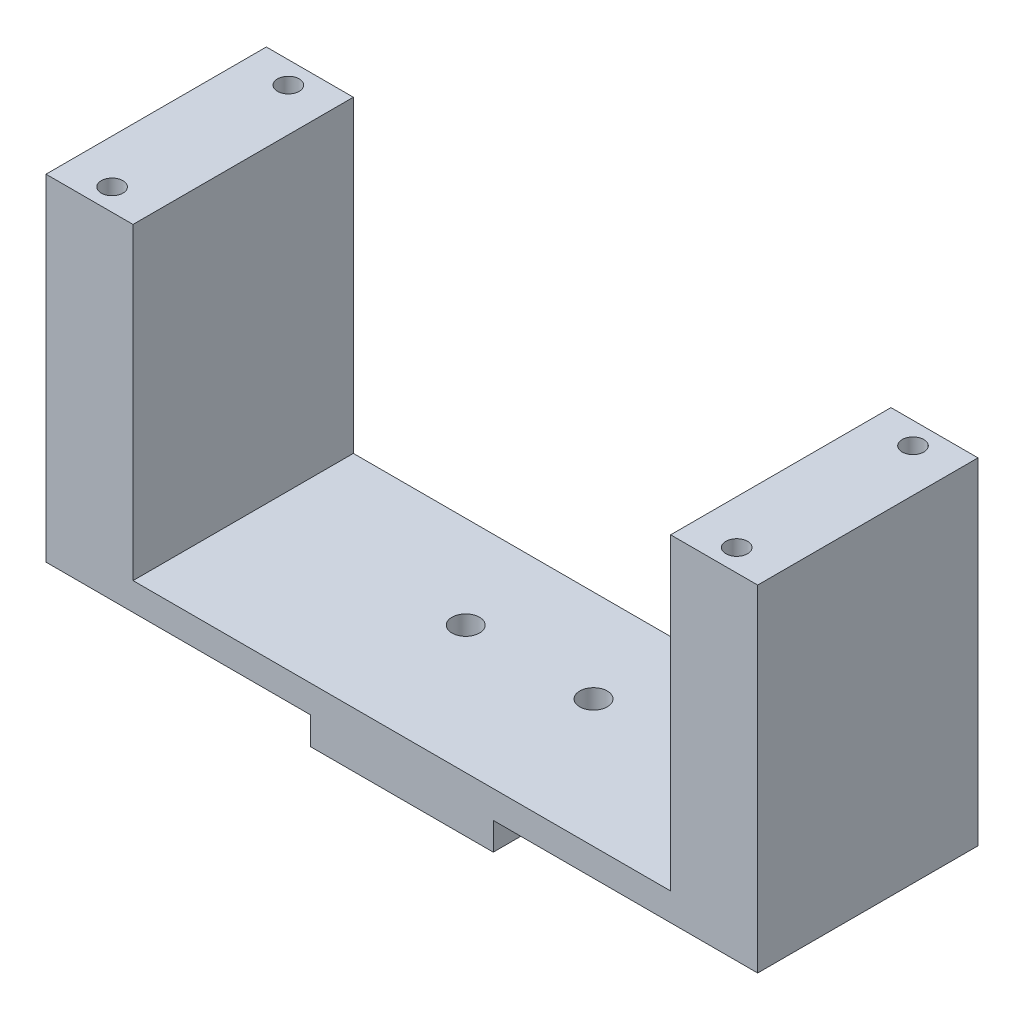
ISO-10303-21;
HEADER;
FILE_DESCRIPTION(('STEP AP214'),'2;1');
FILE_NAME('part.step','',(''),(''),'','','');
FILE_SCHEMA(('AUTOMOTIVE_DESIGN { 1 0 10303 214 1 1 1 1 }'));
ENDSEC;
DATA;
#1=APPLICATION_CONTEXT('core data for automotive mechanical design processes');
#2=APPLICATION_PROTOCOL_DEFINITION('international standard','automotive_design',2000,#1);
#3=PRODUCT_CONTEXT('',#1,'mechanical');
#4=PRODUCT('Part','Part','',(#3));
#5=PRODUCT_RELATED_PRODUCT_CATEGORY('part','',(#4));
#6=PRODUCT_DEFINITION_FORMATION('','',#4);
#7=PRODUCT_DEFINITION_CONTEXT('part definition',#1,'design');
#8=PRODUCT_DEFINITION('design','',#6,#7);
#9=PRODUCT_DEFINITION_SHAPE('','',#8);
#10=(LENGTH_UNIT() NAMED_UNIT(*) SI_UNIT(.MILLI.,.METRE.));
#11=(NAMED_UNIT(*) PLANE_ANGLE_UNIT() SI_UNIT($,.RADIAN.));
#12=(NAMED_UNIT(*) SI_UNIT($,.STERADIAN.) SOLID_ANGLE_UNIT());
#13=UNCERTAINTY_MEASURE_WITH_UNIT(LENGTH_MEASURE(1.E-05),#10,'distance_accuracy_value','');
#14=(GEOMETRIC_REPRESENTATION_CONTEXT(3) GLOBAL_UNCERTAINTY_ASSIGNED_CONTEXT((#13)) GLOBAL_UNIT_ASSIGNED_CONTEXT((#10,
#11,#12)) REPRESENTATION_CONTEXT('',''));
#15=CARTESIAN_POINT('',(0.,0.,0.));
#16=DIRECTION('',(0.,0.,1.));
#17=DIRECTION('',(1.,0.,0.));
#18=AXIS2_PLACEMENT_3D('',#15,#16,#17);
#19=CARTESIAN_POINT('',(0.,0.,0.));
#20=DIRECTION('',(0.,-1.,0.));
#21=DIRECTION('',(0.,0.,-1.));
#22=AXIS2_PLACEMENT_3D('',#19,#20,#21);
#23=PLANE('',#22);
#24=DIRECTION('',(1.,0.,0.));
#25=VECTOR('',#24,1.);
#26=CARTESIAN_POINT('',(-31.111698440208,0.,8.39146447140381));
#27=LINE('',#26,#25);
#28=CARTESIAN_POINT('',(14.354301559792,0.,8.39146447140381));
#29=VERTEX_POINT('',#28);
#30=CARTESIAN_POINT('',(44.834301559792,0.,8.39146447140381));
#31=VERTEX_POINT('',#30);
#32=EDGE_CURVE('E55',#29,#31,#27,.T.);
#33=ORIENTED_EDGE('',*,*,#32,.F.);
#34=DIRECTION('',(0.,0.,-1.));
#35=VECTOR('',#34,1.);
#36=CARTESIAN_POINT('',(14.354301559792,0.,0.));
#37=LINE('',#36,#35);
#38=CARTESIAN_POINT('',(14.354301559792,0.,-17.0085355285962));
#39=VERTEX_POINT('',#38);
#40=EDGE_CURVE('E50',#29,#39,#37,.T.);
#41=ORIENTED_EDGE('',*,*,#40,.T.);
#42=DIRECTION('',(-1.,0.,0.));
#43=VECTOR('',#42,1.);
#44=CARTESIAN_POINT('',(-31.111698440208,0.,-17.0085355285962));
#45=LINE('',#44,#43);
#46=CARTESIAN_POINT('',(44.834301559792,0.,-17.0085355285962));
#47=VERTEX_POINT('',#46);
#48=EDGE_CURVE('E179',#47,#39,#45,.T.);
#49=ORIENTED_EDGE('',*,*,#48,.F.);
#50=DIRECTION('',(0.,0.,-1.));
#51=VECTOR('',#50,1.);
#52=CARTESIAN_POINT('',(44.834301559792,0.,-17.0085355285962));
#53=LINE('',#52,#51);
#54=EDGE_CURVE('E259',#31,#47,#53,.T.);
#55=ORIENTED_EDGE('',*,*,#54,.F.);
#56=EDGE_LOOP('',(#33,#41,#49,#55));
#57=FACE_BOUND('',#56,.T.);
#58=ADVANCED_FACE('F33',(#57),#23,.T.);
#59=CARTESIAN_POINT('',(0.,3.175,0.));
#60=DIRECTION('',(0.,-1.,0.));
#61=DIRECTION('',(0.,0.,-1.));
#62=AXIS2_PLACEMENT_3D('',#59,#60,#61);
#63=PLANE('',#62);
#64=CARTESIAN_POINT('',(11.179301559792,3.175,-6.34053552859619));
#65=DIRECTION('',(0.,-1.,0.));
#66=DIRECTION('',(0.,0.,-1.));
#67=AXIS2_PLACEMENT_3D('',#64,#65,#66);
#68=CIRCLE('',#67,1.5875);
#69=CARTESIAN_POINT('',(11.179301559792,3.175,-7.92803552859619));
#70=VERTEX_POINT('',#69);
#71=EDGE_CURVE('E244',#70,#70,#68,.T.);
#72=ORIENTED_EDGE('',*,*,#71,.T.);
#73=EDGE_LOOP('',(#72));
#74=FACE_BOUND('',#73,.T.);
#75=CARTESIAN_POINT('',(-3.55269844020797,3.175,-6.34053552859619));
#76=DIRECTION('',(0.,-1.,0.));
#77=DIRECTION('',(0.,0.,-1.));
#78=AXIS2_PLACEMENT_3D('',#75,#76,#77);
#79=CIRCLE('',#78,1.5875);
#80=CARTESIAN_POINT('',(-3.55269844020797,3.175,-7.92803552859619));
#81=VERTEX_POINT('',#80);
#82=EDGE_CURVE('E239',#81,#81,#79,.T.);
#83=ORIENTED_EDGE('',*,*,#82,.T.);
#84=EDGE_LOOP('',(#83));
#85=FACE_BOUND('',#84,.T.);
#86=DIRECTION('',(-1.,0.,0.));
#87=VECTOR('',#86,1.);
#88=CARTESIAN_POINT('',(-31.111698440208,3.175,-17.0085355285962));
#89=LINE('',#88,#87);
#90=CARTESIAN_POINT('',(34.801301559792,3.175,-17.0085355285962));
#91=VERTEX_POINT('',#90);
#92=CARTESIAN_POINT('',(-27.174698440208,3.175,-17.0085355285962));
#93=VERTEX_POINT('',#92);
#94=EDGE_CURVE('E11',#91,#93,#89,.T.);
#95=ORIENTED_EDGE('',*,*,#94,.T.);
#96=DIRECTION('',(0.,0.,1.));
#97=VECTOR('',#96,1.);
#98=CARTESIAN_POINT('',(-27.174698440208,3.175,-17.0085355285962));
#99=LINE('',#98,#97);
#100=CARTESIAN_POINT('',(-27.174698440208,3.175,8.39146447140381));
#101=VERTEX_POINT('',#100);
#102=EDGE_CURVE('E228',#93,#101,#99,.T.);
#103=ORIENTED_EDGE('',*,*,#102,.T.);
#104=DIRECTION('',(1.,0.,0.));
#105=VECTOR('',#104,1.);
#106=CARTESIAN_POINT('',(-31.111698440208,3.175,8.39146447140381));
#107=LINE('',#106,#105);
#108=CARTESIAN_POINT('',(34.801301559792,3.175,8.39146447140381));
#109=VERTEX_POINT('',#108);
#110=EDGE_CURVE('E42',#101,#109,#107,.T.);
#111=ORIENTED_EDGE('',*,*,#110,.T.);
#112=DIRECTION('',(0.,0.,1.));
#113=VECTOR('',#112,1.);
#114=CARTESIAN_POINT('',(34.801301559792,3.175,0.));
#115=LINE('',#114,#113);
#116=EDGE_CURVE('E188',#91,#109,#115,.T.);
#117=ORIENTED_EDGE('',*,*,#116,.F.);
#118=EDGE_LOOP('',(#95,#103,#111,#117));
#119=FACE_BOUND('',#118,.T.);
#120=ADVANCED_FACE('F313',(#74,#85,#119),#63,.F.);
#121=CARTESIAN_POINT('',(-31.111698440208,3.175,8.39146447140381));
#122=DIRECTION('',(0.,0.,-1.));
#123=DIRECTION('',(-1.,0.,0.));
#124=AXIS2_PLACEMENT_3D('',#121,#122,#123);
#125=PLANE('',#124);
#126=CARTESIAN_POINT('',(-37.207698440208,0.,8.39146447140381));
#127=VERTEX_POINT('',#126);
#128=CARTESIAN_POINT('',(-6.72769844020797,0.,8.39146447140381));
#129=VERTEX_POINT('',#128);
#130=EDGE_CURVE('E180',#127,#129,#27,.T.);
#131=ORIENTED_EDGE('',*,*,#130,.T.);
#132=DIRECTION('',(0.,1.,0.));
#133=VECTOR('',#132,1.);
#134=CARTESIAN_POINT('',(-6.72769844020797,-3.175,8.39146447140381));
#135=LINE('',#134,#133);
#136=CARTESIAN_POINT('',(-6.72769844020797,-3.175,8.39146447140381));
#137=VERTEX_POINT('',#136);
#138=EDGE_CURVE('E129',#137,#129,#135,.T.);
#139=ORIENTED_EDGE('',*,*,#138,.F.);
#140=DIRECTION('',(-1.,0.,0.));
#141=VECTOR('',#140,1.);
#142=CARTESIAN_POINT('',(0.,-3.175,8.39146447140381));
#143=LINE('',#142,#141);
#144=CARTESIAN_POINT('',(14.354301559792,-3.175,8.39146447140381));
#145=VERTEX_POINT('',#144);
#146=EDGE_CURVE('E132',#145,#137,#143,.T.);
#147=ORIENTED_EDGE('',*,*,#146,.F.);
#148=DIRECTION('',(0.,1.,0.));
#149=VECTOR('',#148,1.);
#150=CARTESIAN_POINT('',(14.354301559792,-3.175,8.39146447140381));
#151=LINE('',#150,#149);
#152=EDGE_CURVE('E121',#145,#29,#151,.T.);
#153=ORIENTED_EDGE('',*,*,#152,.T.);
#154=ORIENTED_EDGE('',*,*,#32,.T.);
#155=DIRECTION('',(0.,-1.,0.));
#156=VECTOR('',#155,1.);
#157=CARTESIAN_POINT('',(44.834301559792,38.735,8.39146447140381));
#158=LINE('',#157,#156);
#159=CARTESIAN_POINT('',(44.834301559792,38.735,8.39146447140381));
#160=VERTEX_POINT('',#159);
#161=EDGE_CURVE('E262',#160,#31,#158,.T.);
#162=ORIENTED_EDGE('',*,*,#161,.F.);
#163=DIRECTION('',(1.,0.,0.));
#164=VECTOR('',#163,1.);
#165=CARTESIAN_POINT('',(0.,38.735,8.39146447140381));
#166=LINE('',#165,#164);
#167=CARTESIAN_POINT('',(34.801301559792,38.735,8.39146447140381));
#168=VERTEX_POINT('',#167);
#169=EDGE_CURVE('E210',#168,#160,#166,.T.);
#170=ORIENTED_EDGE('',*,*,#169,.F.);
#171=DIRECTION('',(0.,-1.,0.));
#172=VECTOR('',#171,1.);
#173=CARTESIAN_POINT('',(34.801301559792,38.735,8.39146447140381));
#174=LINE('',#173,#172);
#175=EDGE_CURVE('E205',#168,#109,#174,.T.);
#176=ORIENTED_EDGE('',*,*,#175,.T.);
#177=ORIENTED_EDGE('',*,*,#110,.F.);
#178=DIRECTION('',(0.,-1.,0.));
#179=VECTOR('',#178,1.);
#180=CARTESIAN_POINT('',(-27.174698440208,38.735,8.39146447140381));
#181=LINE('',#180,#179);
#182=CARTESIAN_POINT('',(-27.174698440208,38.735,8.39146447140381));
#183=VERTEX_POINT('',#182);
#184=EDGE_CURVE('E236',#183,#101,#181,.T.);
#185=ORIENTED_EDGE('',*,*,#184,.F.);
#186=DIRECTION('',(1.,0.,0.));
#187=VECTOR('',#186,1.);
#188=CARTESIAN_POINT('',(-31.111698440208,38.735,8.39146447140381));
#189=LINE('',#188,#187);
#190=CARTESIAN_POINT('',(-37.207698440208,38.735,8.39146447140381));
#191=VERTEX_POINT('',#190);
#192=EDGE_CURVE('E232',#191,#183,#189,.T.);
#193=ORIENTED_EDGE('',*,*,#192,.F.);
#194=DIRECTION('',(0.,1.,0.));
#195=VECTOR('',#194,1.);
#196=CARTESIAN_POINT('',(-37.207698440208,38.735,8.39146447140381));
#197=LINE('',#196,#195);
#198=EDGE_CURVE('E250',#127,#191,#197,.T.);
#199=ORIENTED_EDGE('',*,*,#198,.F.);
#200=EDGE_LOOP('',(#131,#139,#147,#153,#154,#162,#170,#176,#177,#185,#193,#199));
#201=FACE_BOUND('',#200,.T.);
#202=ADVANCED_FACE('F35',(#201),#125,.F.);
#203=CARTESIAN_POINT('',(-31.111698440208,3.175,-17.0085355285962));
#204=DIRECTION('',(0.,0.,1.));
#205=DIRECTION('',(1.,0.,0.));
#206=AXIS2_PLACEMENT_3D('',#203,#204,#205);
#207=PLANE('',#206);
#208=ORIENTED_EDGE('',*,*,#48,.T.);
#209=DIRECTION('',(0.,1.,0.));
#210=VECTOR('',#209,1.);
#211=CARTESIAN_POINT('',(14.354301559792,-3.175,-17.0085355285962));
#212=LINE('',#211,#210);
#213=CARTESIAN_POINT('',(14.354301559792,-3.175,-17.0085355285962));
#214=VERTEX_POINT('',#213);
#215=EDGE_CURVE('E157',#214,#39,#212,.T.);
#216=ORIENTED_EDGE('',*,*,#215,.F.);
#217=DIRECTION('',(1.,0.,0.));
#218=VECTOR('',#217,1.);
#219=CARTESIAN_POINT('',(0.,-3.175,-17.0085355285962));
#220=LINE('',#219,#218);
#221=CARTESIAN_POINT('',(-6.72769844020797,-3.175,-17.0085355285962));
#222=VERTEX_POINT('',#221);
#223=EDGE_CURVE('E142',#222,#214,#220,.T.);
#224=ORIENTED_EDGE('',*,*,#223,.F.);
#225=DIRECTION('',(0.,1.,0.));
#226=VECTOR('',#225,1.);
#227=CARTESIAN_POINT('',(-6.72769844020797,-3.175,-17.0085355285962));
#228=LINE('',#227,#226);
#229=CARTESIAN_POINT('',(-6.72769844020797,0.,-17.0085355285962));
#230=VERTEX_POINT('',#229);
#231=EDGE_CURVE('E165',#222,#230,#228,.T.);
#232=ORIENTED_EDGE('',*,*,#231,.T.);
#233=CARTESIAN_POINT('',(-37.207698440208,0.,-17.0085355285962));
#234=VERTEX_POINT('',#233);
#235=EDGE_CURVE('E176',#230,#234,#45,.T.);
#236=ORIENTED_EDGE('',*,*,#235,.T.);
#237=DIRECTION('',(0.,-1.,0.));
#238=VECTOR('',#237,1.);
#239=CARTESIAN_POINT('',(-37.207698440208,38.735,-17.0085355285962));
#240=LINE('',#239,#238);
#241=CARTESIAN_POINT('',(-37.207698440208,38.735,-17.0085355285962));
#242=VERTEX_POINT('',#241);
#243=EDGE_CURVE('E256',#242,#234,#240,.T.);
#244=ORIENTED_EDGE('',*,*,#243,.F.);
#245=DIRECTION('',(1.,0.,0.));
#246=VECTOR('',#245,1.);
#247=CARTESIAN_POINT('',(-31.111698440208,38.735,-17.0085355285962));
#248=LINE('',#247,#246);
#249=CARTESIAN_POINT('',(-27.174698440208,38.735,-17.0085355285962));
#250=VERTEX_POINT('',#249);
#251=EDGE_CURVE('E225',#242,#250,#248,.T.);
#252=ORIENTED_EDGE('',*,*,#251,.T.);
#253=DIRECTION('',(0.,-1.,0.));
#254=VECTOR('',#253,1.);
#255=CARTESIAN_POINT('',(-27.174698440208,38.735,-17.0085355285962));
#256=LINE('',#255,#254);
#257=EDGE_CURVE('E234',#250,#93,#256,.T.);
#258=ORIENTED_EDGE('',*,*,#257,.T.);
#259=ORIENTED_EDGE('',*,*,#94,.F.);
#260=DIRECTION('',(0.,-1.,0.));
#261=VECTOR('',#260,1.);
#262=CARTESIAN_POINT('',(34.801301559792,38.735,-17.0085355285962));
#263=LINE('',#262,#261);
#264=CARTESIAN_POINT('',(34.801301559792,38.735,-17.0085355285962));
#265=VERTEX_POINT('',#264);
#266=EDGE_CURVE('E201',#265,#91,#263,.T.);
#267=ORIENTED_EDGE('',*,*,#266,.F.);
#268=DIRECTION('',(-1.,0.,0.));
#269=VECTOR('',#268,1.);
#270=CARTESIAN_POINT('',(0.,38.735,-17.0085355285962));
#271=LINE('',#270,#269);
#272=CARTESIAN_POINT('',(44.834301559792,38.735,-17.0085355285962));
#273=VERTEX_POINT('',#272);
#274=EDGE_CURVE('E220',#273,#265,#271,.T.);
#275=ORIENTED_EDGE('',*,*,#274,.F.);
#276=DIRECTION('',(0.,1.,0.));
#277=VECTOR('',#276,1.);
#278=CARTESIAN_POINT('',(44.834301559792,38.735,-17.0085355285962));
#279=LINE('',#278,#277);
#280=EDGE_CURVE('E266',#47,#273,#279,.T.);
#281=ORIENTED_EDGE('',*,*,#280,.F.);
#282=EDGE_LOOP('',(#208,#216,#224,#232,#236,#244,#252,#258,#259,#267,#275,#281));
#283=FACE_BOUND('',#282,.T.);
#284=ADVANCED_FACE('F310',(#283),#207,.F.);
#285=DIRECTION('',(0.,0.,-1.));
#286=VECTOR('',#285,1.);
#287=CARTESIAN_POINT('',(-6.72769844020797,0.,0.));
#288=LINE('',#287,#286);
#289=EDGE_CURVE('E144',#129,#230,#288,.T.);
#290=ORIENTED_EDGE('',*,*,#289,.F.);
#291=ORIENTED_EDGE('',*,*,#130,.F.);
#292=DIRECTION('',(0.,0.,1.));
#293=VECTOR('',#292,1.);
#294=CARTESIAN_POINT('',(-37.207698440208,0.,-17.0085355285962));
#295=LINE('',#294,#293);
#296=EDGE_CURVE('E253',#234,#127,#295,.T.);
#297=ORIENTED_EDGE('',*,*,#296,.F.);
#298=ORIENTED_EDGE('',*,*,#235,.F.);
#299=EDGE_LOOP('',(#290,#291,#297,#298));
#300=FACE_BOUND('',#299,.T.);
#301=ADVANCED_FACE('F318',(#300),#23,.T.);
#302=CARTESIAN_POINT('',(34.801301559792,38.735,0.));
#303=DIRECTION('',(1.,0.,0.));
#304=DIRECTION('',(0.,0.,-1.));
#305=AXIS2_PLACEMENT_3D('',#302,#303,#304);
#306=PLANE('',#305);
#307=ORIENTED_EDGE('',*,*,#116,.T.);
#308=ORIENTED_EDGE('',*,*,#175,.F.);
#309=DIRECTION('',(0.,0.,1.));
#310=VECTOR('',#309,1.);
#311=CARTESIAN_POINT('',(34.801301559792,38.735,0.));
#312=LINE('',#311,#310);
#313=EDGE_CURVE('E216',#265,#168,#312,.T.);
#314=ORIENTED_EDGE('',*,*,#313,.F.);
#315=ORIENTED_EDGE('',*,*,#266,.T.);
#316=EDGE_LOOP('',(#307,#308,#314,#315));
#317=FACE_BOUND('',#316,.T.);
#318=ADVANCED_FACE('F305',(#317),#306,.F.);
#319=CARTESIAN_POINT('',(0.,38.735,0.));
#320=DIRECTION('',(0.,1.,0.));
#321=DIRECTION('',(0.,0.,1.));
#322=AXIS2_PLACEMENT_3D('',#319,#320,#321);
#323=PLANE('',#322);
#324=CARTESIAN_POINT('',(39.881301559792,38.735,5.85146447140381));
#325=DIRECTION('',(0.,1.,0.));
#326=DIRECTION('',(0.,0.,1.));
#327=AXIS2_PLACEMENT_3D('',#324,#325,#326);
#328=CIRCLE('',#327,1.25);
#329=CARTESIAN_POINT('',(39.881301559792,38.735,7.10146447140382));
#330=VERTEX_POINT('',#329);
#331=EDGE_CURVE('E128',#330,#330,#328,.T.);
#332=ORIENTED_EDGE('',*,*,#331,.F.);
#333=EDGE_LOOP('',(#332));
#334=FACE_BOUND('',#333,.T.);
#335=CARTESIAN_POINT('',(39.881301559792,38.735,-14.4685355285962));
#336=DIRECTION('',(0.,1.,0.));
#337=DIRECTION('',(0.,0.,1.));
#338=AXIS2_PLACEMENT_3D('',#335,#336,#337);
#339=CIRCLE('',#338,1.25);
#340=CARTESIAN_POINT('',(39.881301559792,38.735,-13.2185355285962));
#341=VERTEX_POINT('',#340);
#342=EDGE_CURVE('E282',#341,#341,#339,.T.);
#343=ORIENTED_EDGE('',*,*,#342,.F.);
#344=EDGE_LOOP('',(#343));
#345=FACE_BOUND('',#344,.T.);
#346=ORIENTED_EDGE('',*,*,#274,.T.);
#347=ORIENTED_EDGE('',*,*,#313,.T.);
#348=ORIENTED_EDGE('',*,*,#169,.T.);
#349=DIRECTION('',(0.,0.,1.));
#350=VECTOR('',#349,1.);
#351=CARTESIAN_POINT('',(44.834301559792,38.735,-17.0085355285962));
#352=LINE('',#351,#350);
#353=EDGE_CURVE('E264',#273,#160,#352,.T.);
#354=ORIENTED_EDGE('',*,*,#353,.F.);
#355=EDGE_LOOP('',(#346,#347,#348,#354));
#356=FACE_BOUND('',#355,.T.);
#357=ADVANCED_FACE('F301',(#334,#345,#356),#323,.T.);
#358=CARTESIAN_POINT('',(-27.174698440208,38.735,-17.0085355285962));
#359=DIRECTION('',(1.,0.,0.));
#360=DIRECTION('',(0.,0.,-1.));
#361=AXIS2_PLACEMENT_3D('',#358,#359,#360);
#362=PLANE('',#361);
#363=ORIENTED_EDGE('',*,*,#102,.F.);
#364=ORIENTED_EDGE('',*,*,#257,.F.);
#365=DIRECTION('',(0.,0.,1.));
#366=VECTOR('',#365,1.);
#367=CARTESIAN_POINT('',(-27.174698440208,38.735,-17.0085355285962));
#368=LINE('',#367,#366);
#369=EDGE_CURVE('E229',#250,#183,#368,.T.);
#370=ORIENTED_EDGE('',*,*,#369,.T.);
#371=ORIENTED_EDGE('',*,*,#184,.T.);
#372=EDGE_LOOP('',(#363,#364,#370,#371));
#373=FACE_BOUND('',#372,.T.);
#374=ADVANCED_FACE('F304',(#373),#362,.T.);
#375=CARTESIAN_POINT('',(0.,38.735,0.));
#376=DIRECTION('',(0.,-1.,0.));
#377=DIRECTION('',(0.,0.,-1.));
#378=AXIS2_PLACEMENT_3D('',#375,#376,#377);
#379=PLANE('',#378);
#380=CARTESIAN_POINT('',(-32.127698440208,38.735,5.85146447140381));
#381=DIRECTION('',(0.,1.,0.));
#382=DIRECTION('',(0.,0.,1.));
#383=AXIS2_PLACEMENT_3D('',#380,#381,#382);
#384=CIRCLE('',#383,1.25);
#385=CARTESIAN_POINT('',(-32.127698440208,38.735,7.10146447140381));
#386=VERTEX_POINT('',#385);
#387=EDGE_CURVE('E276',#386,#386,#384,.T.);
#388=ORIENTED_EDGE('',*,*,#387,.F.);
#389=EDGE_LOOP('',(#388));
#390=FACE_BOUND('',#389,.T.);
#391=CARTESIAN_POINT('',(-32.127698440208,38.735,-14.4685355285962));
#392=DIRECTION('',(0.,1.,0.));
#393=DIRECTION('',(0.,0.,1.));
#394=AXIS2_PLACEMENT_3D('',#391,#392,#393);
#395=CIRCLE('',#394,1.25);
#396=CARTESIAN_POINT('',(-32.127698440208,38.735,-13.2185355285962));
#397=VERTEX_POINT('',#396);
#398=EDGE_CURVE('E270',#397,#397,#395,.T.);
#399=ORIENTED_EDGE('',*,*,#398,.F.);
#400=EDGE_LOOP('',(#399));
#401=FACE_BOUND('',#400,.T.);
#402=ORIENTED_EDGE('',*,*,#251,.F.);
#403=DIRECTION('',(0.,0.,-1.));
#404=VECTOR('',#403,1.);
#405=CARTESIAN_POINT('',(-37.207698440208,38.735,-17.0085355285962));
#406=LINE('',#405,#404);
#407=EDGE_CURVE('E247',#191,#242,#406,.T.);
#408=ORIENTED_EDGE('',*,*,#407,.F.);
#409=ORIENTED_EDGE('',*,*,#192,.T.);
#410=ORIENTED_EDGE('',*,*,#369,.F.);
#411=EDGE_LOOP('',(#402,#408,#409,#410));
#412=FACE_BOUND('',#411,.T.);
#413=ADVANCED_FACE('F382',(#390,#401,#412),#379,.F.);
#414=CARTESIAN_POINT('',(-3.55269844020797,35.56,-6.34053552859619));
#415=DIRECTION('',(0.,-1.,0.));
#416=DIRECTION('',(0.,0.,-1.));
#417=AXIS2_PLACEMENT_3D('',#414,#415,#416);
#418=CYLINDRICAL_SURFACE('',#417,1.5875);
#419=ORIENTED_EDGE('',*,*,#82,.F.);
#420=EDGE_LOOP('',(#419));
#421=FACE_BOUND('',#420,.T.);
#422=CARTESIAN_POINT('',(-3.55269844020797,-3.175,-6.34053552859619));
#423=DIRECTION('',(0.,-1.,0.));
#424=DIRECTION('',(0.,0.,-1.));
#425=AXIS2_PLACEMENT_3D('',#422,#423,#424);
#426=CIRCLE('',#425,1.5875);
#427=CARTESIAN_POINT('',(-3.55269844020797,-3.175,-7.92803552859619));
#428=VERTEX_POINT('',#427);
#429=EDGE_CURVE('E154',#428,#428,#426,.F.);
#430=ORIENTED_EDGE('',*,*,#429,.F.);
#431=EDGE_LOOP('',(#430));
#432=FACE_BOUND('',#431,.T.);
#433=ADVANCED_FACE('F378',(#421,#432),#418,.F.);
#434=CARTESIAN_POINT('',(11.179301559792,35.56,-6.34053552859619));
#435=DIRECTION('',(0.,-1.,0.));
#436=DIRECTION('',(0.,0.,-1.));
#437=AXIS2_PLACEMENT_3D('',#434,#435,#436);
#438=CYLINDRICAL_SURFACE('',#437,1.5875);
#439=ORIENTED_EDGE('',*,*,#71,.F.);
#440=EDGE_LOOP('',(#439));
#441=FACE_BOUND('',#440,.T.);
#442=CARTESIAN_POINT('',(11.179301559792,-3.175,-6.34053552859619));
#443=DIRECTION('',(0.,-1.,0.));
#444=DIRECTION('',(0.,0.,-1.));
#445=AXIS2_PLACEMENT_3D('',#442,#443,#444);
#446=CIRCLE('',#445,1.5875);
#447=CARTESIAN_POINT('',(11.179301559792,-3.175,-7.92803552859619));
#448=VERTEX_POINT('',#447);
#449=EDGE_CURVE('E151',#448,#448,#446,.F.);
#450=ORIENTED_EDGE('',*,*,#449,.F.);
#451=EDGE_LOOP('',(#450));
#452=FACE_BOUND('',#451,.T.);
#453=ADVANCED_FACE('F374',(#441,#452),#438,.F.);
#454=CARTESIAN_POINT('',(-37.207698440208,0.,0.));
#455=DIRECTION('',(-1.,0.,0.));
#456=DIRECTION('',(0.,0.,1.));
#457=AXIS2_PLACEMENT_3D('',#454,#455,#456);
#458=PLANE('',#457);
#459=ORIENTED_EDGE('',*,*,#243,.T.);
#460=ORIENTED_EDGE('',*,*,#296,.T.);
#461=ORIENTED_EDGE('',*,*,#198,.T.);
#462=ORIENTED_EDGE('',*,*,#407,.T.);
#463=EDGE_LOOP('',(#459,#460,#461,#462));
#464=FACE_BOUND('',#463,.T.);
#465=ADVANCED_FACE('F371',(#464),#458,.T.);
#466=CARTESIAN_POINT('',(44.834301559792,0.,0.));
#467=DIRECTION('',(-1.,0.,0.));
#468=DIRECTION('',(0.,0.,1.));
#469=AXIS2_PLACEMENT_3D('',#466,#467,#468);
#470=PLANE('',#469);
#471=ORIENTED_EDGE('',*,*,#280,.T.);
#472=ORIENTED_EDGE('',*,*,#353,.T.);
#473=ORIENTED_EDGE('',*,*,#161,.T.);
#474=ORIENTED_EDGE('',*,*,#54,.T.);
#475=EDGE_LOOP('',(#471,#472,#473,#474));
#476=FACE_BOUND('',#475,.T.);
#477=ADVANCED_FACE('F315',(#476),#470,.F.);
#478=CARTESIAN_POINT('',(-32.127698440208,18.161,-14.4685355285962));
#479=DIRECTION('',(0.,1.,0.));
#480=DIRECTION('',(0.,0.,1.));
#481=AXIS2_PLACEMENT_3D('',#478,#479,#480);
#482=CYLINDRICAL_SURFACE('',#481,1.25);
#483=CARTESIAN_POINT('',(-32.127698440208,18.161,-14.4685355285962));
#484=DIRECTION('',(0.,1.,0.));
#485=DIRECTION('',(0.,0.,1.));
#486=AXIS2_PLACEMENT_3D('',#483,#484,#485);
#487=CIRCLE('',#486,1.25);
#488=CARTESIAN_POINT('',(-32.127698440208,18.161,-13.2185355285962));
#489=VERTEX_POINT('',#488);
#490=EDGE_CURVE('E269',#489,#489,#487,.T.);
#491=ORIENTED_EDGE('',*,*,#490,.F.);
#492=EDGE_LOOP('',(#491));
#493=FACE_BOUND('',#492,.T.);
#494=ORIENTED_EDGE('',*,*,#398,.T.);
#495=EDGE_LOOP('',(#494));
#496=FACE_BOUND('',#495,.T.);
#497=ADVANCED_FACE('F364',(#493,#496),#482,.F.);
#498=CARTESIAN_POINT('',(-32.127698440208,18.161,-14.4685355285962));
#499=DIRECTION('',(0.,1.,0.));
#500=DIRECTION('',(0.,0.,1.));
#501=AXIS2_PLACEMENT_3D('',#498,#499,#500);
#502=PLANE('',#501);
#503=ORIENTED_EDGE('',*,*,#490,.T.);
#504=EDGE_LOOP('',(#503));
#505=FACE_BOUND('',#504,.T.);
#506=ADVANCED_FACE('F360',(#505),#502,.T.);
#507=CARTESIAN_POINT('',(-32.127698440208,18.161,5.85146447140381));
#508=DIRECTION('',(0.,1.,0.));
#509=DIRECTION('',(0.,0.,1.));
#510=AXIS2_PLACEMENT_3D('',#507,#508,#509);
#511=CYLINDRICAL_SURFACE('',#510,1.25);
#512=CARTESIAN_POINT('',(-32.127698440208,18.161,5.85146447140381));
#513=DIRECTION('',(0.,1.,0.));
#514=DIRECTION('',(0.,0.,1.));
#515=AXIS2_PLACEMENT_3D('',#512,#513,#514);
#516=CIRCLE('',#515,1.25);
#517=CARTESIAN_POINT('',(-32.127698440208,18.161,7.10146447140381));
#518=VERTEX_POINT('',#517);
#519=EDGE_CURVE('E273',#518,#518,#516,.T.);
#520=ORIENTED_EDGE('',*,*,#519,.F.);
#521=EDGE_LOOP('',(#520));
#522=FACE_BOUND('',#521,.T.);
#523=ORIENTED_EDGE('',*,*,#387,.T.);
#524=EDGE_LOOP('',(#523));
#525=FACE_BOUND('',#524,.T.);
#526=ADVANCED_FACE('F356',(#522,#525),#511,.F.);
#527=CARTESIAN_POINT('',(-32.127698440208,18.161,5.85146447140381));
#528=DIRECTION('',(0.,1.,0.));
#529=DIRECTION('',(0.,0.,1.));
#530=AXIS2_PLACEMENT_3D('',#527,#528,#529);
#531=PLANE('',#530);
#532=ORIENTED_EDGE('',*,*,#519,.T.);
#533=EDGE_LOOP('',(#532));
#534=FACE_BOUND('',#533,.T.);
#535=ADVANCED_FACE('F352',(#534),#531,.T.);
#536=CARTESIAN_POINT('',(39.881301559792,18.161,-14.4685355285962));
#537=DIRECTION('',(0.,1.,0.));
#538=DIRECTION('',(0.,0.,1.));
#539=AXIS2_PLACEMENT_3D('',#536,#537,#538);
#540=CYLINDRICAL_SURFACE('',#539,1.25);
#541=CARTESIAN_POINT('',(39.881301559792,18.161,-14.4685355285962));
#542=DIRECTION('',(0.,1.,0.));
#543=DIRECTION('',(0.,0.,1.));
#544=AXIS2_PLACEMENT_3D('',#541,#542,#543);
#545=CIRCLE('',#544,1.25);
#546=CARTESIAN_POINT('',(39.881301559792,18.161,-13.2185355285962));
#547=VERTEX_POINT('',#546);
#548=EDGE_CURVE('E279',#547,#547,#545,.T.);
#549=ORIENTED_EDGE('',*,*,#548,.F.);
#550=EDGE_LOOP('',(#549));
#551=FACE_BOUND('',#550,.T.);
#552=ORIENTED_EDGE('',*,*,#342,.T.);
#553=EDGE_LOOP('',(#552));
#554=FACE_BOUND('',#553,.T.);
#555=ADVANCED_FACE('F348',(#551,#554),#540,.F.);
#556=CARTESIAN_POINT('',(39.881301559792,18.161,-14.4685355285962));
#557=DIRECTION('',(0.,1.,0.));
#558=DIRECTION('',(0.,0.,1.));
#559=AXIS2_PLACEMENT_3D('',#556,#557,#558);
#560=PLANE('',#559);
#561=ORIENTED_EDGE('',*,*,#548,.T.);
#562=EDGE_LOOP('',(#561));
#563=FACE_BOUND('',#562,.T.);
#564=ADVANCED_FACE('F297',(#563),#560,.T.);
#565=CARTESIAN_POINT('',(39.881301559792,18.161,5.85146447140381));
#566=DIRECTION('',(0.,1.,0.));
#567=DIRECTION('',(0.,0.,1.));
#568=AXIS2_PLACEMENT_3D('',#565,#566,#567);
#569=CYLINDRICAL_SURFACE('',#568,1.25);
#570=CARTESIAN_POINT('',(39.881301559792,18.161,5.85146447140381));
#571=DIRECTION('',(0.,1.,0.));
#572=DIRECTION('',(0.,0.,1.));
#573=AXIS2_PLACEMENT_3D('',#570,#571,#572);
#574=CIRCLE('',#573,1.25);
#575=CARTESIAN_POINT('',(39.881301559792,18.161,7.10146447140382));
#576=VERTEX_POINT('',#575);
#577=EDGE_CURVE('E285',#576,#576,#574,.T.);
#578=ORIENTED_EDGE('',*,*,#577,.F.);
#579=EDGE_LOOP('',(#578));
#580=FACE_BOUND('',#579,.T.);
#581=ORIENTED_EDGE('',*,*,#331,.T.);
#582=EDGE_LOOP('',(#581));
#583=FACE_BOUND('',#582,.T.);
#584=ADVANCED_FACE('F294',(#580,#583),#569,.F.);
#585=CARTESIAN_POINT('',(39.881301559792,18.161,5.85146447140381));
#586=DIRECTION('',(0.,1.,0.));
#587=DIRECTION('',(0.,0.,1.));
#588=AXIS2_PLACEMENT_3D('',#585,#586,#587);
#589=PLANE('',#588);
#590=ORIENTED_EDGE('',*,*,#577,.T.);
#591=EDGE_LOOP('',(#590));
#592=FACE_BOUND('',#591,.T.);
#593=ADVANCED_FACE('F292',(#592),#589,.T.);
#594=CARTESIAN_POINT('',(14.354301559792,-3.175,0.));
#595=DIRECTION('',(1.,0.,0.));
#596=DIRECTION('',(0.,0.,-1.));
#597=AXIS2_PLACEMENT_3D('',#594,#595,#596);
#598=PLANE('',#597);
#599=ORIENTED_EDGE('',*,*,#40,.F.);
#600=ORIENTED_EDGE('',*,*,#152,.F.);
#601=DIRECTION('',(0.,0.,-1.));
#602=VECTOR('',#601,1.);
#603=CARTESIAN_POINT('',(14.354301559792,-3.175,0.));
#604=LINE('',#603,#602);
#605=EDGE_CURVE('E126',#145,#214,#604,.T.);
#606=ORIENTED_EDGE('',*,*,#605,.T.);
#607=ORIENTED_EDGE('',*,*,#215,.T.);
#608=EDGE_LOOP('',(#599,#600,#606,#607));
#609=FACE_BOUND('',#608,.T.);
#610=ADVANCED_FACE('F123',(#609),#598,.T.);
#611=CARTESIAN_POINT('',(-6.72769844020797,-3.175,0.));
#612=DIRECTION('',(1.,0.,0.));
#613=DIRECTION('',(0.,0.,-1.));
#614=AXIS2_PLACEMENT_3D('',#611,#612,#613);
#615=PLANE('',#614);
#616=ORIENTED_EDGE('',*,*,#289,.T.);
#617=ORIENTED_EDGE('',*,*,#231,.F.);
#618=DIRECTION('',(0.,0.,-1.));
#619=VECTOR('',#618,1.);
#620=CARTESIAN_POINT('',(-6.72769844020797,-3.175,0.));
#621=LINE('',#620,#619);
#622=EDGE_CURVE('E137',#137,#222,#621,.T.);
#623=ORIENTED_EDGE('',*,*,#622,.F.);
#624=ORIENTED_EDGE('',*,*,#138,.T.);
#625=EDGE_LOOP('',(#616,#617,#623,#624));
#626=FACE_BOUND('',#625,.T.);
#627=ADVANCED_FACE('F334',(#626),#615,.F.);
#628=CARTESIAN_POINT('',(0.,-3.175,0.));
#629=DIRECTION('',(0.,-1.,0.));
#630=DIRECTION('',(0.,0.,-1.));
#631=AXIS2_PLACEMENT_3D('',#628,#629,#630);
#632=PLANE('',#631);
#633=ORIENTED_EDGE('',*,*,#605,.F.);
#634=ORIENTED_EDGE('',*,*,#146,.T.);
#635=ORIENTED_EDGE('',*,*,#622,.T.);
#636=ORIENTED_EDGE('',*,*,#223,.T.);
#637=EDGE_LOOP('',(#633,#634,#635,#636));
#638=FACE_BOUND('',#637,.T.);
#639=ORIENTED_EDGE('',*,*,#449,.T.);
#640=EDGE_LOOP('',(#639));
#641=FACE_BOUND('',#640,.T.);
#642=ORIENTED_EDGE('',*,*,#429,.T.);
#643=EDGE_LOOP('',(#642));
#644=FACE_BOUND('',#643,.T.);
#645=ADVANCED_FACE('F139',(#638,#641,#644),#632,.T.);
#646=CLOSED_SHELL('',(#58,#120,#202,#284,#301,#318,#357,#374,#413,#433,#453,#465,#477,#497,#506,
#526,#535,#555,#564,#584,#593,#610,#627,#645));
#647=MANIFOLD_SOLID_BREP('B2',#646);
#648=ADVANCED_BREP_SHAPE_REPRESENTATION('',(#18,#647),#14);
#649=SHAPE_DEFINITION_REPRESENTATION(#9,#648);
ENDSEC;
END-ISO-10303-21;
